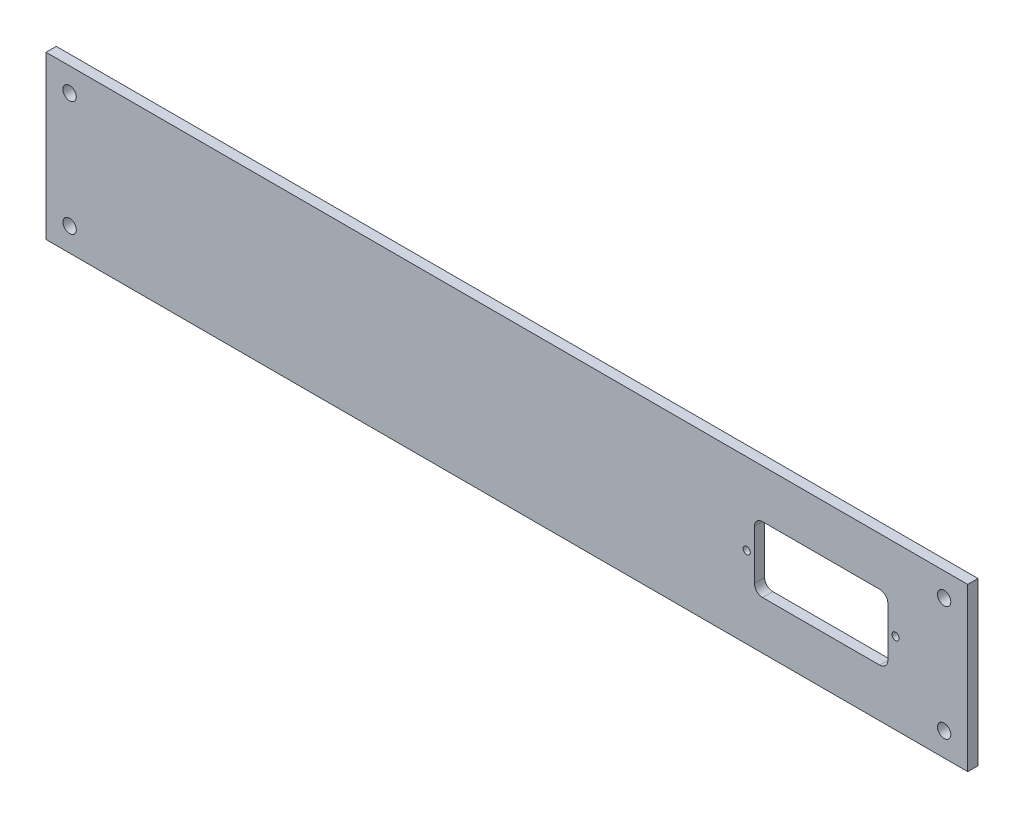
ISO-10303-21;
HEADER;
FILE_DESCRIPTION(('STEP AP214'),'2;1');
FILE_NAME('part.step','',(''),(''),'','','');
FILE_SCHEMA(('AUTOMOTIVE_DESIGN { 1 0 10303 214 1 1 1 1 }'));
ENDSEC;
DATA;
#1=APPLICATION_CONTEXT('core data for automotive mechanical design processes');
#2=APPLICATION_PROTOCOL_DEFINITION('international standard','automotive_design',2000,#1);
#3=PRODUCT_CONTEXT('',#1,'mechanical');
#4=PRODUCT('Part','Part','',(#3));
#5=PRODUCT_RELATED_PRODUCT_CATEGORY('part','',(#4));
#6=PRODUCT_DEFINITION_FORMATION('','',#4);
#7=PRODUCT_DEFINITION_CONTEXT('part definition',#1,'design');
#8=PRODUCT_DEFINITION('design','',#6,#7);
#9=PRODUCT_DEFINITION_SHAPE('','',#8);
#10=(LENGTH_UNIT() NAMED_UNIT(*) SI_UNIT(.MILLI.,.METRE.));
#11=(NAMED_UNIT(*) PLANE_ANGLE_UNIT() SI_UNIT($,.RADIAN.));
#12=(NAMED_UNIT(*) SI_UNIT($,.STERADIAN.) SOLID_ANGLE_UNIT());
#13=UNCERTAINTY_MEASURE_WITH_UNIT(LENGTH_MEASURE(1.E-05),#10,'distance_accuracy_value','');
#14=(GEOMETRIC_REPRESENTATION_CONTEXT(3) GLOBAL_UNCERTAINTY_ASSIGNED_CONTEXT((#13)) GLOBAL_UNIT_ASSIGNED_CONTEXT((#10,
#11,#12)) REPRESENTATION_CONTEXT('',''));
#15=CARTESIAN_POINT('',(0.,0.,0.));
#16=DIRECTION('',(0.,0.,1.));
#17=DIRECTION('',(1.,0.,0.));
#18=AXIS2_PLACEMENT_3D('',#15,#16,#17);
#19=CARTESIAN_POINT('',(0.,0.,5.));
#20=DIRECTION('',(0.,0.,-1.));
#21=DIRECTION('',(-1.,0.,0.));
#22=AXIS2_PLACEMENT_3D('',#19,#20,#21);
#23=PLANE('',#22);
#24=CARTESIAN_POINT('',(413.824633799864,39.5055064167184,5.));
#25=DIRECTION('',(0.,0.,-1.));
#26=DIRECTION('',(-1.,0.,0.));
#27=AXIS2_PLACEMENT_3D('',#24,#25,#26);
#28=CIRCLE('',#27,1.74999999999998);
#29=CARTESIAN_POINT('',(412.074633799864,39.5055064167184,5.));
#30=VERTEX_POINT('',#29);
#31=EDGE_CURVE('E188',#30,#30,#28,.T.);
#32=ORIENTED_EDGE('',*,*,#31,.T.);
#33=EDGE_LOOP('',(#32));
#34=FACE_BOUND('',#33,.T.);
#35=DIRECTION('',(0.,1.,0.));
#36=VECTOR('',#35,1.);
#37=CARTESIAN_POINT('',(345.074633799864,51.5,5.));
#38=LINE('',#37,#36);
#39=CARTESIAN_POINT('',(345.074633799864,27.5,5.));
#40=VERTEX_POINT('',#39);
#41=CARTESIAN_POINT('',(345.074633799864,51.5,5.));
#42=VERTEX_POINT('',#41);
#43=EDGE_CURVE('E151',#40,#42,#38,.T.);
#44=ORIENTED_EDGE('',*,*,#43,.T.);
#45=CARTESIAN_POINT('',(349.074633799864,51.5,5.));
#46=DIRECTION('',(0.,0.,-1.));
#47=DIRECTION('',(-1.,0.,0.));
#48=AXIS2_PLACEMENT_3D('',#45,#46,#47);
#49=CIRCLE('',#48,4.);
#50=CARTESIAN_POINT('',(349.074633799864,55.5,5.));
#51=VERTEX_POINT('',#50);
#52=EDGE_CURVE('E145',#42,#51,#49,.T.);
#53=ORIENTED_EDGE('',*,*,#52,.T.);
#54=DIRECTION('',(1.,0.,0.));
#55=VECTOR('',#54,1.);
#56=CARTESIAN_POINT('',(349.074633799864,55.5,5.));
#57=LINE('',#56,#55);
#58=CARTESIAN_POINT('',(406.074633799864,55.5,5.));
#59=VERTEX_POINT('',#58);
#60=EDGE_CURVE('E154',#51,#59,#57,.T.);
#61=ORIENTED_EDGE('',*,*,#60,.T.);
#62=CARTESIAN_POINT('',(406.074633799864,51.4999999999999,5.));
#63=DIRECTION('',(0.,0.,-1.));
#64=DIRECTION('',(1.,0.,0.));
#65=AXIS2_PLACEMENT_3D('',#62,#63,#64);
#66=CIRCLE('',#65,4.00000000000001);
#67=CARTESIAN_POINT('',(410.074633799864,51.4999999999999,5.));
#68=VERTEX_POINT('',#67);
#69=EDGE_CURVE('E59',#59,#68,#66,.T.);
#70=ORIENTED_EDGE('',*,*,#69,.T.);
#71=DIRECTION('',(0.,-1.,0.));
#72=VECTOR('',#71,1.);
#73=CARTESIAN_POINT('',(410.074633799864,51.4999999999999,5.));
#74=LINE('',#73,#72);
#75=CARTESIAN_POINT('',(410.074633799864,27.4999999999999,5.));
#76=VERTEX_POINT('',#75);
#77=EDGE_CURVE('E173',#68,#76,#74,.T.);
#78=ORIENTED_EDGE('',*,*,#77,.T.);
#79=CARTESIAN_POINT('',(406.074633799864,27.4999999999999,5.));
#80=DIRECTION('',(0.,0.,-1.));
#81=DIRECTION('',(1.,0.,0.));
#82=AXIS2_PLACEMENT_3D('',#79,#80,#81);
#83=CIRCLE('',#82,3.99999999999999);
#84=CARTESIAN_POINT('',(406.074633799864,23.5,5.));
#85=VERTEX_POINT('',#84);
#86=EDGE_CURVE('E176',#76,#85,#83,.T.);
#87=ORIENTED_EDGE('',*,*,#86,.T.);
#88=DIRECTION('',(-1.,0.,0.));
#89=VECTOR('',#88,1.);
#90=CARTESIAN_POINT('',(349.074633799864,23.5,5.));
#91=LINE('',#90,#89);
#92=CARTESIAN_POINT('',(349.074633799864,23.5,5.));
#93=VERTEX_POINT('',#92);
#94=EDGE_CURVE('E179',#85,#93,#91,.T.);
#95=ORIENTED_EDGE('',*,*,#94,.T.);
#96=CARTESIAN_POINT('',(349.074633799864,27.5,5.));
#97=DIRECTION('',(0.,0.,-1.));
#98=DIRECTION('',(1.,0.,0.));
#99=AXIS2_PLACEMENT_3D('',#96,#97,#98);
#100=CIRCLE('',#99,4.);
#101=EDGE_CURVE('E182',#93,#40,#100,.T.);
#102=ORIENTED_EDGE('',*,*,#101,.T.);
#103=EDGE_LOOP('',(#44,#53,#61,#70,#78,#87,#95,#102));
#104=FACE_BOUND('',#103,.T.);
#105=CARTESIAN_POINT('',(341.324633799864,39.5055064167184,5.));
#106=DIRECTION('',(0.,0.,-1.));
#107=DIRECTION('',(1.,0.,0.));
#108=AXIS2_PLACEMENT_3D('',#105,#106,#107);
#109=CIRCLE('',#108,1.74999999999998);
#110=CARTESIAN_POINT('',(343.074633799864,39.5055064167184,5.));
#111=VERTEX_POINT('',#110);
#112=EDGE_CURVE('E236',#111,#111,#109,.T.);
#113=ORIENTED_EDGE('',*,*,#112,.T.);
#114=EDGE_LOOP('',(#113));
#115=FACE_BOUND('',#114,.T.);
#116=DIRECTION('',(1.,0.,0.));
#117=VECTOR('',#116,1.);
#118=CARTESIAN_POINT('',(449.,0.,5.));
#119=LINE('',#118,#117);
#120=CARTESIAN_POINT('',(0.,0.,5.));
#121=VERTEX_POINT('',#120);
#122=CARTESIAN_POINT('',(449.,0.,5.));
#123=VERTEX_POINT('',#122);
#124=EDGE_CURVE('E267',#121,#123,#119,.T.);
#125=ORIENTED_EDGE('',*,*,#124,.T.);
#126=DIRECTION('',(0.,1.,0.));
#127=VECTOR('',#126,1.);
#128=CARTESIAN_POINT('',(449.,79.,5.));
#129=LINE('',#128,#127);
#130=CARTESIAN_POINT('',(449.,79.,5.));
#131=VERTEX_POINT('',#130);
#132=EDGE_CURVE('E270',#123,#131,#129,.T.);
#133=ORIENTED_EDGE('',*,*,#132,.T.);
#134=DIRECTION('',(-1.,0.,0.));
#135=VECTOR('',#134,1.);
#136=CARTESIAN_POINT('',(0.,79.,5.));
#137=LINE('',#136,#135);
#138=CARTESIAN_POINT('',(0.,79.,5.));
#139=VERTEX_POINT('',#138);
#140=EDGE_CURVE('E273',#131,#139,#137,.T.);
#141=ORIENTED_EDGE('',*,*,#140,.T.);
#142=DIRECTION('',(0.,-1.,0.));
#143=VECTOR('',#142,1.);
#144=CARTESIAN_POINT('',(0.,0.,5.));
#145=LINE('',#144,#143);
#146=EDGE_CURVE('E275',#139,#121,#145,.T.);
#147=ORIENTED_EDGE('',*,*,#146,.T.);
#148=EDGE_LOOP('',(#125,#133,#141,#147));
#149=FACE_BOUND('',#148,.T.);
#150=CARTESIAN_POINT('',(11.5,67.5,5.));
#151=DIRECTION('',(0.,0.,1.));
#152=DIRECTION('',(1.,0.,0.));
#153=AXIS2_PLACEMENT_3D('',#150,#151,#152);
#154=CIRCLE('',#153,3.25);
#155=CARTESIAN_POINT('',(14.75,67.5,5.));
#156=VERTEX_POINT('',#155);
#157=EDGE_CURVE('E265',#156,#156,#154,.T.);
#158=ORIENTED_EDGE('',*,*,#157,.F.);
#159=EDGE_LOOP('',(#158));
#160=FACE_BOUND('',#159,.T.);
#161=CARTESIAN_POINT('',(437.5,67.5,5.));
#162=DIRECTION('',(0.,0.,1.));
#163=DIRECTION('',(-1.,0.,0.));
#164=AXIS2_PLACEMENT_3D('',#161,#162,#163);
#165=CIRCLE('',#164,3.24999999999995);
#166=CARTESIAN_POINT('',(434.25,67.5,5.));
#167=VERTEX_POINT('',#166);
#168=EDGE_CURVE('E266',#167,#167,#165,.T.);
#169=ORIENTED_EDGE('',*,*,#168,.F.);
#170=EDGE_LOOP('',(#169));
#171=FACE_BOUND('',#170,.T.);
#172=CARTESIAN_POINT('',(11.5,11.5,5.));
#173=DIRECTION('',(0.,0.,1.));
#174=DIRECTION('',(-1.,0.,0.));
#175=AXIS2_PLACEMENT_3D('',#172,#173,#174);
#176=CIRCLE('',#175,3.25);
#177=CARTESIAN_POINT('',(8.25,11.5,5.));
#178=VERTEX_POINT('',#177);
#179=EDGE_CURVE('E251',#178,#178,#176,.T.);
#180=ORIENTED_EDGE('',*,*,#179,.F.);
#181=EDGE_LOOP('',(#180));
#182=FACE_BOUND('',#181,.T.);
#183=CARTESIAN_POINT('',(437.5,11.5,5.));
#184=DIRECTION('',(0.,0.,1.));
#185=DIRECTION('',(1.,0.,0.));
#186=AXIS2_PLACEMENT_3D('',#183,#184,#185);
#187=CIRCLE('',#186,3.24999999999995);
#188=CARTESIAN_POINT('',(440.75,11.5,5.));
#189=VERTEX_POINT('',#188);
#190=EDGE_CURVE('E243',#189,#189,#187,.T.);
#191=ORIENTED_EDGE('',*,*,#190,.F.);
#192=EDGE_LOOP('',(#191));
#193=FACE_BOUND('',#192,.T.);
#194=ADVANCED_FACE('F44',(#34,#104,#115,#149,#160,#171,#182,#193),#23,.F.);
#195=CARTESIAN_POINT('',(0.,0.,0.));
#196=DIRECTION('',(0.,0.,-1.));
#197=DIRECTION('',(-1.,0.,0.));
#198=AXIS2_PLACEMENT_3D('',#195,#196,#197);
#199=PLANE('',#198);
#200=CARTESIAN_POINT('',(413.824633799864,39.5055064167184,0.));
#201=DIRECTION('',(0.,0.,-1.));
#202=DIRECTION('',(-1.,0.,0.));
#203=AXIS2_PLACEMENT_3D('',#200,#201,#202);
#204=CIRCLE('',#203,1.74999999999998);
#205=CARTESIAN_POINT('',(412.074633799864,39.5055064167184,0.));
#206=VERTEX_POINT('',#205);
#207=EDGE_CURVE('E168',#206,#206,#204,.T.);
#208=ORIENTED_EDGE('',*,*,#207,.F.);
#209=EDGE_LOOP('',(#208));
#210=FACE_BOUND('',#209,.T.);
#211=CARTESIAN_POINT('',(349.074633799864,51.5,0.));
#212=DIRECTION('',(0.,0.,-1.));
#213=DIRECTION('',(-1.,0.,0.));
#214=AXIS2_PLACEMENT_3D('',#211,#212,#213);
#215=CIRCLE('',#214,4.);
#216=CARTESIAN_POINT('',(345.074633799864,51.5,0.));
#217=VERTEX_POINT('',#216);
#218=CARTESIAN_POINT('',(349.074633799864,55.5,0.));
#219=VERTEX_POINT('',#218);
#220=EDGE_CURVE('E70',#217,#219,#215,.T.);
#221=ORIENTED_EDGE('',*,*,#220,.F.);
#222=DIRECTION('',(0.,1.,0.));
#223=VECTOR('',#222,1.);
#224=CARTESIAN_POINT('',(345.074633799864,51.5,0.));
#225=LINE('',#224,#223);
#226=CARTESIAN_POINT('',(345.074633799864,27.5,0.));
#227=VERTEX_POINT('',#226);
#228=EDGE_CURVE('E161',#227,#217,#225,.T.);
#229=ORIENTED_EDGE('',*,*,#228,.F.);
#230=CARTESIAN_POINT('',(349.074633799864,27.5,0.));
#231=DIRECTION('',(0.,0.,-1.));
#232=DIRECTION('',(1.,0.,0.));
#233=AXIS2_PLACEMENT_3D('',#230,#231,#232);
#234=CIRCLE('',#233,4.);
#235=CARTESIAN_POINT('',(349.074633799864,23.5,0.));
#236=VERTEX_POINT('',#235);
#237=EDGE_CURVE('E165',#236,#227,#234,.T.);
#238=ORIENTED_EDGE('',*,*,#237,.F.);
#239=DIRECTION('',(-1.,0.,0.));
#240=VECTOR('',#239,1.);
#241=CARTESIAN_POINT('',(349.074633799864,23.5,0.));
#242=LINE('',#241,#240);
#243=CARTESIAN_POINT('',(406.074633799864,23.5,0.));
#244=VERTEX_POINT('',#243);
#245=EDGE_CURVE('E213',#244,#236,#242,.T.);
#246=ORIENTED_EDGE('',*,*,#245,.F.);
#247=CARTESIAN_POINT('',(406.074633799864,27.4999999999999,0.));
#248=DIRECTION('',(0.,0.,-1.));
#249=DIRECTION('',(1.,0.,0.));
#250=AXIS2_PLACEMENT_3D('',#247,#248,#249);
#251=CIRCLE('',#250,3.99999999999999);
#252=CARTESIAN_POINT('',(410.074633799864,27.4999999999999,0.));
#253=VERTEX_POINT('',#252);
#254=EDGE_CURVE('E208',#253,#244,#251,.T.);
#255=ORIENTED_EDGE('',*,*,#254,.F.);
#256=DIRECTION('',(0.,-1.,0.));
#257=VECTOR('',#256,1.);
#258=CARTESIAN_POINT('',(410.074633799864,51.4999999999999,0.));
#259=LINE('',#258,#257);
#260=CARTESIAN_POINT('',(410.074633799864,51.4999999999999,0.));
#261=VERTEX_POINT('',#260);
#262=EDGE_CURVE('E204',#261,#253,#259,.T.);
#263=ORIENTED_EDGE('',*,*,#262,.F.);
#264=CARTESIAN_POINT('',(406.074633799864,51.4999999999999,0.));
#265=DIRECTION('',(0.,0.,-1.));
#266=DIRECTION('',(1.,0.,0.));
#267=AXIS2_PLACEMENT_3D('',#264,#265,#266);
#268=CIRCLE('',#267,4.00000000000001);
#269=CARTESIAN_POINT('',(406.074633799864,55.5,0.));
#270=VERTEX_POINT('',#269);
#271=EDGE_CURVE('E192',#270,#261,#268,.T.);
#272=ORIENTED_EDGE('',*,*,#271,.F.);
#273=DIRECTION('',(1.,0.,0.));
#274=VECTOR('',#273,1.);
#275=CARTESIAN_POINT('',(349.074633799864,55.5,0.));
#276=LINE('',#275,#274);
#277=EDGE_CURVE('E187',#219,#270,#276,.T.);
#278=ORIENTED_EDGE('',*,*,#277,.F.);
#279=EDGE_LOOP('',(#221,#229,#238,#246,#255,#263,#272,#278));
#280=FACE_BOUND('',#279,.T.);
#281=CARTESIAN_POINT('',(341.324633799864,39.5055064167184,0.));
#282=DIRECTION('',(0.,0.,-1.));
#283=DIRECTION('',(1.,0.,0.));
#284=AXIS2_PLACEMENT_3D('',#281,#282,#283);
#285=CIRCLE('',#284,1.74999999999998);
#286=CARTESIAN_POINT('',(343.074633799864,39.5055064167184,0.));
#287=VERTEX_POINT('',#286);
#288=EDGE_CURVE('E224',#287,#287,#285,.T.);
#289=ORIENTED_EDGE('',*,*,#288,.F.);
#290=EDGE_LOOP('',(#289));
#291=FACE_BOUND('',#290,.T.);
#292=CARTESIAN_POINT('',(11.5,11.5,0.));
#293=DIRECTION('',(0.,0.,1.));
#294=DIRECTION('',(-1.,0.,0.));
#295=AXIS2_PLACEMENT_3D('',#292,#293,#294);
#296=CIRCLE('',#295,3.25);
#297=CARTESIAN_POINT('',(8.25,11.5,0.));
#298=VERTEX_POINT('',#297);
#299=EDGE_CURVE('E246',#298,#298,#296,.T.);
#300=ORIENTED_EDGE('',*,*,#299,.T.);
#301=EDGE_LOOP('',(#300));
#302=FACE_BOUND('',#301,.T.);
#303=CARTESIAN_POINT('',(11.5,67.5,0.));
#304=DIRECTION('',(0.,0.,1.));
#305=DIRECTION('',(1.,0.,0.));
#306=AXIS2_PLACEMENT_3D('',#303,#304,#305);
#307=CIRCLE('',#306,3.25);
#308=CARTESIAN_POINT('',(14.75,67.5,0.));
#309=VERTEX_POINT('',#308);
#310=EDGE_CURVE('E259',#309,#309,#307,.T.);
#311=ORIENTED_EDGE('',*,*,#310,.T.);
#312=EDGE_LOOP('',(#311));
#313=FACE_BOUND('',#312,.T.);
#314=DIRECTION('',(1.,0.,0.));
#315=VECTOR('',#314,1.);
#316=CARTESIAN_POINT('',(449.,0.,0.));
#317=LINE('',#316,#315);
#318=CARTESIAN_POINT('',(0.,0.,0.));
#319=VERTEX_POINT('',#318);
#320=CARTESIAN_POINT('',(449.,0.,0.));
#321=VERTEX_POINT('',#320);
#322=EDGE_CURVE('E278',#319,#321,#317,.T.);
#323=ORIENTED_EDGE('',*,*,#322,.F.);
#324=DIRECTION('',(0.,-1.,0.));
#325=VECTOR('',#324,1.);
#326=CARTESIAN_POINT('',(0.,0.,0.));
#327=LINE('',#326,#325);
#328=CARTESIAN_POINT('',(0.,79.,0.));
#329=VERTEX_POINT('',#328);
#330=EDGE_CURVE('E271',#329,#319,#327,.T.);
#331=ORIENTED_EDGE('',*,*,#330,.F.);
#332=DIRECTION('',(-1.,0.,0.));
#333=VECTOR('',#332,1.);
#334=CARTESIAN_POINT('',(0.,79.,0.));
#335=LINE('',#334,#333);
#336=CARTESIAN_POINT('',(449.,79.,0.));
#337=VERTEX_POINT('',#336);
#338=EDGE_CURVE('E283',#337,#329,#335,.T.);
#339=ORIENTED_EDGE('',*,*,#338,.F.);
#340=DIRECTION('',(0.,1.,0.));
#341=VECTOR('',#340,1.);
#342=CARTESIAN_POINT('',(449.,79.,0.));
#343=LINE('',#342,#341);
#344=EDGE_CURVE('E281',#321,#337,#343,.T.);
#345=ORIENTED_EDGE('',*,*,#344,.F.);
#346=EDGE_LOOP('',(#323,#331,#339,#345));
#347=FACE_BOUND('',#346,.T.);
#348=CARTESIAN_POINT('',(437.5,67.5,0.));
#349=DIRECTION('',(0.,0.,1.));
#350=DIRECTION('',(-1.,0.,0.));
#351=AXIS2_PLACEMENT_3D('',#348,#349,#350);
#352=CIRCLE('',#351,3.24999999999995);
#353=CARTESIAN_POINT('',(434.25,67.5,0.));
#354=VERTEX_POINT('',#353);
#355=EDGE_CURVE('E415',#354,#354,#352,.T.);
#356=ORIENTED_EDGE('',*,*,#355,.T.);
#357=EDGE_LOOP('',(#356));
#358=FACE_BOUND('',#357,.T.);
#359=CARTESIAN_POINT('',(437.5,11.5,0.));
#360=DIRECTION('',(0.,0.,1.));
#361=DIRECTION('',(1.,0.,0.));
#362=AXIS2_PLACEMENT_3D('',#359,#360,#361);
#363=CIRCLE('',#362,3.24999999999995);
#364=CARTESIAN_POINT('',(440.75,11.5,0.));
#365=VERTEX_POINT('',#364);
#366=EDGE_CURVE('E238',#365,#365,#363,.T.);
#367=ORIENTED_EDGE('',*,*,#366,.T.);
#368=EDGE_LOOP('',(#367));
#369=FACE_BOUND('',#368,.T.);
#370=ADVANCED_FACE('F301',(#210,#280,#291,#302,#313,#347,#358,#369),#199,.T.);
#371=CARTESIAN_POINT('',(449.,0.,5.));
#372=DIRECTION('',(0.,1.,0.));
#373=DIRECTION('',(-1.,0.,0.));
#374=AXIS2_PLACEMENT_3D('',#371,#372,#373);
#375=PLANE('',#374);
#376=ORIENTED_EDGE('',*,*,#322,.T.);
#377=DIRECTION('',(0.,0.,-1.));
#378=VECTOR('',#377,1.);
#379=CARTESIAN_POINT('',(449.,0.,5.));
#380=LINE('',#379,#378);
#381=EDGE_CURVE('E12',#123,#321,#380,.T.);
#382=ORIENTED_EDGE('',*,*,#381,.F.);
#383=ORIENTED_EDGE('',*,*,#124,.F.);
#384=DIRECTION('',(0.,0.,-1.));
#385=VECTOR('',#384,1.);
#386=CARTESIAN_POINT('',(0.,0.,5.));
#387=LINE('',#386,#385);
#388=EDGE_CURVE('E277',#121,#319,#387,.T.);
#389=ORIENTED_EDGE('',*,*,#388,.T.);
#390=EDGE_LOOP('',(#376,#382,#383,#389));
#391=FACE_BOUND('',#390,.T.);
#392=ADVANCED_FACE('F46',(#391),#375,.F.);
#393=CARTESIAN_POINT('',(449.,79.,5.));
#394=DIRECTION('',(-1.,0.,0.));
#395=DIRECTION('',(0.,0.,1.));
#396=AXIS2_PLACEMENT_3D('',#393,#394,#395);
#397=PLANE('',#396);
#398=ORIENTED_EDGE('',*,*,#344,.T.);
#399=DIRECTION('',(0.,0.,-1.));
#400=VECTOR('',#399,1.);
#401=CARTESIAN_POINT('',(449.,79.,5.));
#402=LINE('',#401,#400);
#403=EDGE_CURVE('E52',#131,#337,#402,.T.);
#404=ORIENTED_EDGE('',*,*,#403,.F.);
#405=ORIENTED_EDGE('',*,*,#132,.F.);
#406=ORIENTED_EDGE('',*,*,#381,.T.);
#407=EDGE_LOOP('',(#398,#404,#405,#406));
#408=FACE_BOUND('',#407,.T.);
#409=ADVANCED_FACE('F312',(#408),#397,.F.);
#410=CARTESIAN_POINT('',(0.,79.,5.));
#411=DIRECTION('',(0.,-1.,0.));
#412=DIRECTION('',(0.,0.,-1.));
#413=AXIS2_PLACEMENT_3D('',#410,#411,#412);
#414=PLANE('',#413);
#415=ORIENTED_EDGE('',*,*,#338,.T.);
#416=DIRECTION('',(0.,0.,-1.));
#417=VECTOR('',#416,1.);
#418=CARTESIAN_POINT('',(0.,79.,5.));
#419=LINE('',#418,#417);
#420=EDGE_CURVE('E288',#139,#329,#419,.T.);
#421=ORIENTED_EDGE('',*,*,#420,.F.);
#422=ORIENTED_EDGE('',*,*,#140,.F.);
#423=ORIENTED_EDGE('',*,*,#403,.T.);
#424=EDGE_LOOP('',(#415,#421,#422,#423));
#425=FACE_BOUND('',#424,.T.);
#426=ADVANCED_FACE('F295',(#425),#414,.F.);
#427=CARTESIAN_POINT('',(0.,0.,5.));
#428=DIRECTION('',(1.,0.,0.));
#429=DIRECTION('',(0.,1.,0.));
#430=AXIS2_PLACEMENT_3D('',#427,#428,#429);
#431=PLANE('',#430);
#432=ORIENTED_EDGE('',*,*,#330,.T.);
#433=ORIENTED_EDGE('',*,*,#388,.F.);
#434=ORIENTED_EDGE('',*,*,#146,.F.);
#435=ORIENTED_EDGE('',*,*,#420,.T.);
#436=EDGE_LOOP('',(#432,#433,#434,#435));
#437=FACE_BOUND('',#436,.T.);
#438=ADVANCED_FACE('F305',(#437),#431,.F.);
#439=CARTESIAN_POINT('',(11.5,67.5,5.));
#440=DIRECTION('',(0.,0.,-1.));
#441=DIRECTION('',(-1.,0.,0.));
#442=AXIS2_PLACEMENT_3D('',#439,#440,#441);
#443=CYLINDRICAL_SURFACE('',#442,3.25);
#444=ORIENTED_EDGE('',*,*,#157,.T.);
#445=EDGE_LOOP('',(#444));
#446=FACE_BOUND('',#445,.T.);
#447=ORIENTED_EDGE('',*,*,#310,.F.);
#448=EDGE_LOOP('',(#447));
#449=FACE_BOUND('',#448,.T.);
#450=ADVANCED_FACE('F329',(#446,#449),#443,.F.);
#451=CARTESIAN_POINT('',(437.5,67.5,5.));
#452=DIRECTION('',(0.,0.,-1.));
#453=DIRECTION('',(-1.,0.,0.));
#454=AXIS2_PLACEMENT_3D('',#451,#452,#453);
#455=CYLINDRICAL_SURFACE('',#454,3.24999999999995);
#456=ORIENTED_EDGE('',*,*,#168,.T.);
#457=EDGE_LOOP('',(#456));
#458=FACE_BOUND('',#457,.T.);
#459=ORIENTED_EDGE('',*,*,#355,.F.);
#460=EDGE_LOOP('',(#459));
#461=FACE_BOUND('',#460,.T.);
#462=ADVANCED_FACE('F336',(#458,#461),#455,.F.);
#463=CARTESIAN_POINT('',(11.5,11.5,5.));
#464=DIRECTION('',(0.,0.,-1.));
#465=DIRECTION('',(-1.,0.,0.));
#466=AXIS2_PLACEMENT_3D('',#463,#464,#465);
#467=CYLINDRICAL_SURFACE('',#466,3.25);
#468=ORIENTED_EDGE('',*,*,#179,.T.);
#469=EDGE_LOOP('',(#468));
#470=FACE_BOUND('',#469,.T.);
#471=ORIENTED_EDGE('',*,*,#299,.F.);
#472=EDGE_LOOP('',(#471));
#473=FACE_BOUND('',#472,.T.);
#474=ADVANCED_FACE('F341',(#470,#473),#467,.F.);
#475=CARTESIAN_POINT('',(437.5,11.5,5.));
#476=DIRECTION('',(0.,0.,-1.));
#477=DIRECTION('',(-1.,0.,0.));
#478=AXIS2_PLACEMENT_3D('',#475,#476,#477);
#479=CYLINDRICAL_SURFACE('',#478,3.24999999999995);
#480=ORIENTED_EDGE('',*,*,#190,.T.);
#481=EDGE_LOOP('',(#480));
#482=FACE_BOUND('',#481,.T.);
#483=ORIENTED_EDGE('',*,*,#366,.F.);
#484=EDGE_LOOP('',(#483));
#485=FACE_BOUND('',#484,.T.);
#486=ADVANCED_FACE('F357',(#482,#485),#479,.F.);
#487=CARTESIAN_POINT('',(341.324633799864,39.5055064167184,5.));
#488=DIRECTION('',(0.,0.,-1.));
#489=DIRECTION('',(-1.,0.,0.));
#490=AXIS2_PLACEMENT_3D('',#487,#488,#489);
#491=CYLINDRICAL_SURFACE('',#490,1.74999999999998);
#492=ORIENTED_EDGE('',*,*,#112,.F.);
#493=EDGE_LOOP('',(#492));
#494=FACE_BOUND('',#493,.T.);
#495=ORIENTED_EDGE('',*,*,#288,.T.);
#496=EDGE_LOOP('',(#495));
#497=FACE_BOUND('',#496,.T.);
#498=ADVANCED_FACE('F360',(#494,#497),#491,.F.);
#499=CARTESIAN_POINT('',(349.074633799864,51.5,5.));
#500=DIRECTION('',(0.,0.,-1.));
#501=DIRECTION('',(-1.,0.,0.));
#502=AXIS2_PLACEMENT_3D('',#499,#500,#501);
#503=CYLINDRICAL_SURFACE('',#502,4.);
#504=ORIENTED_EDGE('',*,*,#220,.T.);
#505=DIRECTION('',(0.,0.,-1.));
#506=VECTOR('',#505,1.);
#507=CARTESIAN_POINT('',(349.074633799864,55.5,5.));
#508=LINE('',#507,#506);
#509=EDGE_CURVE('E141',#51,#219,#508,.T.);
#510=ORIENTED_EDGE('',*,*,#509,.F.);
#511=ORIENTED_EDGE('',*,*,#52,.F.);
#512=DIRECTION('',(0.,0.,-1.));
#513=VECTOR('',#512,1.);
#514=CARTESIAN_POINT('',(345.074633799864,51.5,5.));
#515=LINE('',#514,#513);
#516=EDGE_CURVE('E222',#42,#217,#515,.T.);
#517=ORIENTED_EDGE('',*,*,#516,.T.);
#518=EDGE_LOOP('',(#504,#510,#511,#517));
#519=FACE_BOUND('',#518,.T.);
#520=ADVANCED_FACE('F143',(#519),#503,.F.);
#521=CARTESIAN_POINT('',(345.074633799864,51.5,5.));
#522=DIRECTION('',(-1.,0.,0.));
#523=DIRECTION('',(0.,0.,1.));
#524=AXIS2_PLACEMENT_3D('',#521,#522,#523);
#525=PLANE('',#524);
#526=ORIENTED_EDGE('',*,*,#228,.T.);
#527=ORIENTED_EDGE('',*,*,#516,.F.);
#528=ORIENTED_EDGE('',*,*,#43,.F.);
#529=DIRECTION('',(0.,0.,-1.));
#530=VECTOR('',#529,1.);
#531=CARTESIAN_POINT('',(345.074633799864,27.5,5.));
#532=LINE('',#531,#530);
#533=EDGE_CURVE('E225',#40,#227,#532,.T.);
#534=ORIENTED_EDGE('',*,*,#533,.T.);
#535=EDGE_LOOP('',(#526,#527,#528,#534));
#536=FACE_BOUND('',#535,.T.);
#537=ADVANCED_FACE('F375',(#536),#525,.F.);
#538=CARTESIAN_POINT('',(349.074633799864,27.5,5.));
#539=DIRECTION('',(0.,0.,-1.));
#540=DIRECTION('',(-1.,0.,0.));
#541=AXIS2_PLACEMENT_3D('',#538,#539,#540);
#542=CYLINDRICAL_SURFACE('',#541,4.);
#543=ORIENTED_EDGE('',*,*,#237,.T.);
#544=ORIENTED_EDGE('',*,*,#533,.F.);
#545=ORIENTED_EDGE('',*,*,#101,.F.);
#546=DIRECTION('',(0.,0.,-1.));
#547=VECTOR('',#546,1.);
#548=CARTESIAN_POINT('',(349.074633799864,23.5,5.));
#549=LINE('',#548,#547);
#550=EDGE_CURVE('E227',#93,#236,#549,.T.);
#551=ORIENTED_EDGE('',*,*,#550,.T.);
#552=EDGE_LOOP('',(#543,#544,#545,#551));
#553=FACE_BOUND('',#552,.T.);
#554=ADVANCED_FACE('F393',(#553),#542,.F.);
#555=CARTESIAN_POINT('',(349.074633799864,23.5,5.));
#556=DIRECTION('',(0.,-1.,0.));
#557=DIRECTION('',(0.,0.,-1.));
#558=AXIS2_PLACEMENT_3D('',#555,#556,#557);
#559=PLANE('',#558);
#560=ORIENTED_EDGE('',*,*,#245,.T.);
#561=ORIENTED_EDGE('',*,*,#550,.F.);
#562=ORIENTED_EDGE('',*,*,#94,.F.);
#563=DIRECTION('',(0.,0.,-1.));
#564=VECTOR('',#563,1.);
#565=CARTESIAN_POINT('',(406.074633799864,23.5,5.));
#566=LINE('',#565,#564);
#567=EDGE_CURVE('E229',#85,#244,#566,.T.);
#568=ORIENTED_EDGE('',*,*,#567,.T.);
#569=EDGE_LOOP('',(#560,#561,#562,#568));
#570=FACE_BOUND('',#569,.T.);
#571=ADVANCED_FACE('F389',(#570),#559,.F.);
#572=CARTESIAN_POINT('',(406.074633799864,27.4999999999999,5.));
#573=DIRECTION('',(0.,0.,-1.));
#574=DIRECTION('',(-1.,0.,0.));
#575=AXIS2_PLACEMENT_3D('',#572,#573,#574);
#576=CYLINDRICAL_SURFACE('',#575,3.99999999999999);
#577=ORIENTED_EDGE('',*,*,#254,.T.);
#578=ORIENTED_EDGE('',*,*,#567,.F.);
#579=ORIENTED_EDGE('',*,*,#86,.F.);
#580=DIRECTION('',(0.,0.,-1.));
#581=VECTOR('',#580,1.);
#582=CARTESIAN_POINT('',(410.074633799864,27.4999999999999,5.));
#583=LINE('',#582,#581);
#584=EDGE_CURVE('E231',#76,#253,#583,.T.);
#585=ORIENTED_EDGE('',*,*,#584,.T.);
#586=EDGE_LOOP('',(#577,#578,#579,#585));
#587=FACE_BOUND('',#586,.T.);
#588=ADVANCED_FACE('F385',(#587),#576,.F.);
#589=CARTESIAN_POINT('',(410.074633799864,51.4999999999999,5.));
#590=DIRECTION('',(1.,0.,0.));
#591=DIRECTION('',(0.,0.,-1.));
#592=AXIS2_PLACEMENT_3D('',#589,#590,#591);
#593=PLANE('',#592);
#594=ORIENTED_EDGE('',*,*,#262,.T.);
#595=ORIENTED_EDGE('',*,*,#584,.F.);
#596=ORIENTED_EDGE('',*,*,#77,.F.);
#597=DIRECTION('',(0.,0.,-1.));
#598=VECTOR('',#597,1.);
#599=CARTESIAN_POINT('',(410.074633799864,51.4999999999999,5.));
#600=LINE('',#599,#598);
#601=EDGE_CURVE('E233',#68,#261,#600,.T.);
#602=ORIENTED_EDGE('',*,*,#601,.T.);
#603=EDGE_LOOP('',(#594,#595,#596,#602));
#604=FACE_BOUND('',#603,.T.);
#605=ADVANCED_FACE('F382',(#604),#593,.F.);
#606=CARTESIAN_POINT('',(406.074633799864,51.4999999999999,5.));
#607=DIRECTION('',(0.,0.,-1.));
#608=DIRECTION('',(-1.,0.,0.));
#609=AXIS2_PLACEMENT_3D('',#606,#607,#608);
#610=CYLINDRICAL_SURFACE('',#609,4.00000000000001);
#611=ORIENTED_EDGE('',*,*,#271,.T.);
#612=ORIENTED_EDGE('',*,*,#601,.F.);
#613=ORIENTED_EDGE('',*,*,#69,.F.);
#614=DIRECTION('',(0.,0.,-1.));
#615=VECTOR('',#614,1.);
#616=CARTESIAN_POINT('',(406.074633799864,55.5,5.));
#617=LINE('',#616,#615);
#618=EDGE_CURVE('E150',#59,#270,#617,.T.);
#619=ORIENTED_EDGE('',*,*,#618,.T.);
#620=EDGE_LOOP('',(#611,#612,#613,#619));
#621=FACE_BOUND('',#620,.T.);
#622=ADVANCED_FACE('F379',(#621),#610,.F.);
#623=CARTESIAN_POINT('',(349.074633799864,55.5,5.));
#624=DIRECTION('',(0.,1.,0.));
#625=DIRECTION('',(-1.,0.,0.));
#626=AXIS2_PLACEMENT_3D('',#623,#624,#625);
#627=PLANE('',#626);
#628=ORIENTED_EDGE('',*,*,#277,.T.);
#629=ORIENTED_EDGE('',*,*,#618,.F.);
#630=ORIENTED_EDGE('',*,*,#60,.F.);
#631=ORIENTED_EDGE('',*,*,#509,.T.);
#632=EDGE_LOOP('',(#628,#629,#630,#631));
#633=FACE_BOUND('',#632,.T.);
#634=ADVANCED_FACE('F155',(#633),#627,.F.);
#635=CARTESIAN_POINT('',(413.824633799864,39.5055064167184,5.));
#636=DIRECTION('',(0.,0.,-1.));
#637=DIRECTION('',(-1.,0.,0.));
#638=AXIS2_PLACEMENT_3D('',#635,#636,#637);
#639=CYLINDRICAL_SURFACE('',#638,1.74999999999998);
#640=ORIENTED_EDGE('',*,*,#31,.F.);
#641=EDGE_LOOP('',(#640));
#642=FACE_BOUND('',#641,.T.);
#643=ORIENTED_EDGE('',*,*,#207,.T.);
#644=EDGE_LOOP('',(#643));
#645=FACE_BOUND('',#644,.T.);
#646=ADVANCED_FACE('F378',(#642,#645),#639,.F.);
#647=CLOSED_SHELL('',(#194,#370,#392,#409,#426,#438,#450,#462,#474,#486,#498,#520,#537,#554,
#571,#588,#605,#622,#634,#646));
#648=MANIFOLD_SOLID_BREP('B2',#647);
#649=ADVANCED_BREP_SHAPE_REPRESENTATION('',(#18,#648),#14);
#650=SHAPE_DEFINITION_REPRESENTATION(#9,#649);
ENDSEC;
END-ISO-10303-21;
